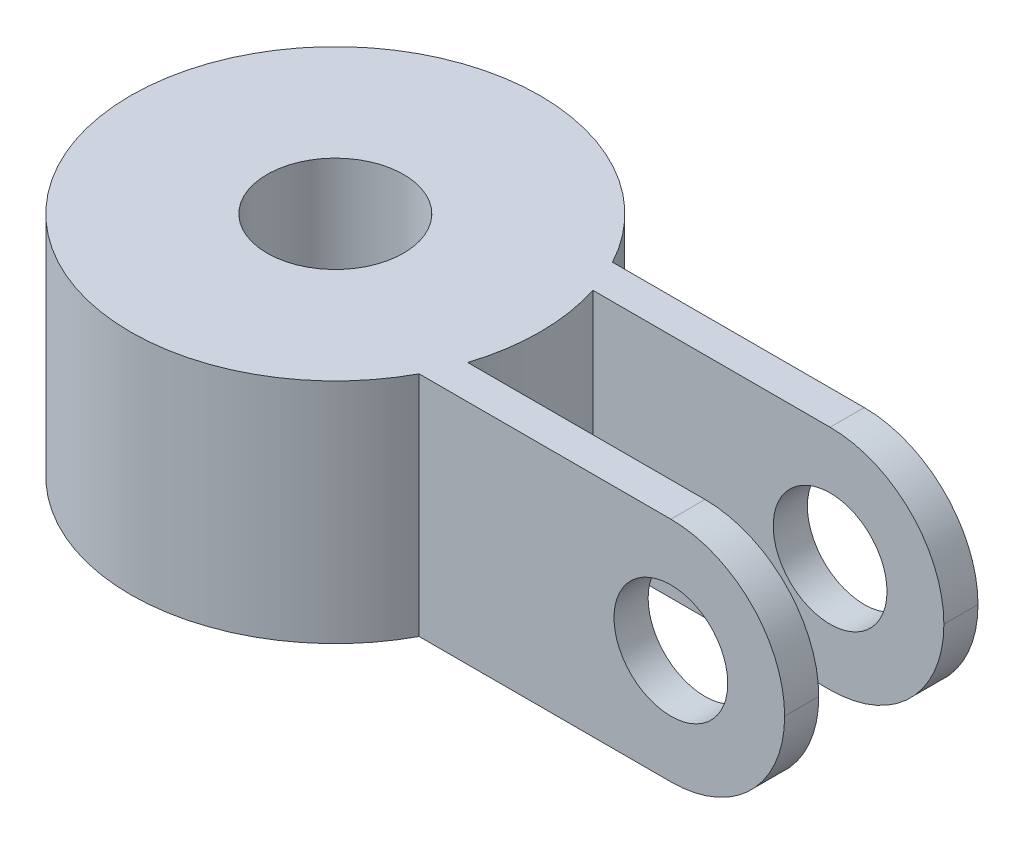
ISO-10303-21;
HEADER;
FILE_DESCRIPTION(('STEP AP214'),'2;1');
FILE_NAME('part.step','',(''),(''),'','','');
FILE_SCHEMA(('AUTOMOTIVE_DESIGN { 1 0 10303 214 1 1 1 1 }'));
ENDSEC;
DATA;
#1=APPLICATION_CONTEXT('core data for automotive mechanical design processes');
#2=APPLICATION_PROTOCOL_DEFINITION('international standard','automotive_design',2000,#1);
#3=PRODUCT_CONTEXT('',#1,'mechanical');
#4=PRODUCT('Part','Part','',(#3));
#5=PRODUCT_RELATED_PRODUCT_CATEGORY('part','',(#4));
#6=PRODUCT_DEFINITION_FORMATION('','',#4);
#7=PRODUCT_DEFINITION_CONTEXT('part definition',#1,'design');
#8=PRODUCT_DEFINITION('design','',#6,#7);
#9=PRODUCT_DEFINITION_SHAPE('','',#8);
#10=(LENGTH_UNIT() NAMED_UNIT(*) SI_UNIT(.MILLI.,.METRE.));
#11=(NAMED_UNIT(*) PLANE_ANGLE_UNIT() SI_UNIT($,.RADIAN.));
#12=(NAMED_UNIT(*) SI_UNIT($,.STERADIAN.) SOLID_ANGLE_UNIT());
#13=UNCERTAINTY_MEASURE_WITH_UNIT(LENGTH_MEASURE(1.E-05),#10,'distance_accuracy_value','');
#14=(GEOMETRIC_REPRESENTATION_CONTEXT(3) GLOBAL_UNCERTAINTY_ASSIGNED_CONTEXT((#13)) GLOBAL_UNIT_ASSIGNED_CONTEXT((#10,
#11,#12)) REPRESENTATION_CONTEXT('',''));
#15=CARTESIAN_POINT('',(0.,0.,0.));
#16=DIRECTION('',(0.,0.,1.));
#17=DIRECTION('',(1.,0.,0.));
#18=AXIS2_PLACEMENT_3D('',#15,#16,#17);
#19=CARTESIAN_POINT('',(0.,10.,0.));
#20=DIRECTION('',(0.,-1.,0.));
#21=DIRECTION('',(0.,0.,-1.));
#22=AXIS2_PLACEMENT_3D('',#19,#20,#21);
#23=CYLINDRICAL_SURFACE('',#22,9.);
#24=CARTESIAN_POINT('',(0.,10.,0.));
#25=DIRECTION('',(0.,1.,0.));
#26=DIRECTION('',(0.,0.,1.));
#27=AXIS2_PLACEMENT_3D('',#24,#25,#26);
#28=CIRCLE('',#27,9.);
#29=CARTESIAN_POINT('',(7.93331582631122,10.,-4.25));
#30=VERTEX_POINT('',#29);
#31=CARTESIAN_POINT('',(7.93331582631122,10.,4.25));
#32=VERTEX_POINT('',#31);
#33=EDGE_CURVE('E117',#30,#32,#28,.T.);
#34=ORIENTED_EDGE('',*,*,#33,.F.);
#35=DIRECTION('',(0.,-1.,0.));
#36=VECTOR('',#35,1.);
#37=CARTESIAN_POINT('',(7.93331582631122,26.9286114453922,-4.25));
#38=LINE('',#37,#36);
#39=CARTESIAN_POINT('',(7.93331582631122,0.,-4.25));
#40=VERTEX_POINT('',#39);
#41=EDGE_CURVE('E124',#30,#40,#38,.T.);
#42=ORIENTED_EDGE('',*,*,#41,.T.);
#43=CARTESIAN_POINT('',(0.,0.,0.));
#44=DIRECTION('',(0.,1.,0.));
#45=DIRECTION('',(0.,0.,1.));
#46=AXIS2_PLACEMENT_3D('',#43,#44,#45);
#47=CIRCLE('',#46,9.);
#48=CARTESIAN_POINT('',(7.93331582631122,0.,4.25));
#49=VERTEX_POINT('',#48);
#50=EDGE_CURVE('E142',#40,#49,#47,.T.);
#51=ORIENTED_EDGE('',*,*,#50,.T.);
#52=DIRECTION('',(0.,-1.,0.));
#53=VECTOR('',#52,1.);
#54=CARTESIAN_POINT('',(7.93331582631122,26.9286114453922,4.25));
#55=LINE('',#54,#53);
#56=EDGE_CURVE('E135',#32,#49,#55,.T.);
#57=ORIENTED_EDGE('',*,*,#56,.F.);
#58=EDGE_LOOP('',(#34,#42,#51,#57));
#59=FACE_BOUND('',#58,.T.);
#60=ADVANCED_FACE('F32',(#59),#23,.T.);
#61=CARTESIAN_POINT('',(0.,10.,0.));
#62=DIRECTION('',(0.,1.,0.));
#63=DIRECTION('',(0.,0.,1.));
#64=AXIS2_PLACEMENT_3D('',#61,#62,#63);
#65=PLANE('',#64);
#66=DIRECTION('',(-1.,0.,0.));
#67=VECTOR('',#66,1.);
#68=CARTESIAN_POINT('',(24.,10.,-2.75));
#69=LINE('',#68,#67);
#70=CARTESIAN_POINT('',(19.,10.,-2.75));
#71=VERTEX_POINT('',#70);
#72=CARTESIAN_POINT('',(8.56956825050131,10.,-2.75));
#73=VERTEX_POINT('',#72);
#74=EDGE_CURVE('E123',#71,#73,#69,.T.);
#75=ORIENTED_EDGE('',*,*,#74,.F.);
#76=DIRECTION('',(0.,0.,1.));
#77=VECTOR('',#76,1.);
#78=CARTESIAN_POINT('',(19.,10.,0.));
#79=LINE('',#78,#77);
#80=CARTESIAN_POINT('',(19.,10.,-4.25));
#81=VERTEX_POINT('',#80);
#82=EDGE_CURVE('E120',#71,#81,#79,.F.);
#83=ORIENTED_EDGE('',*,*,#82,.T.);
#84=DIRECTION('',(1.,0.,0.));
#85=VECTOR('',#84,1.);
#86=CARTESIAN_POINT('',(7.93331582631122,10.,-4.25));
#87=LINE('',#86,#85);
#88=EDGE_CURVE('E110',#30,#81,#87,.T.);
#89=ORIENTED_EDGE('',*,*,#88,.F.);
#90=ORIENTED_EDGE('',*,*,#33,.T.);
#91=DIRECTION('',(-1.,0.,0.));
#92=VECTOR('',#91,1.);
#93=CARTESIAN_POINT('',(7.93331582631122,10.,4.25));
#94=LINE('',#93,#92);
#95=CARTESIAN_POINT('',(19.,10.,4.25));
#96=VERTEX_POINT('',#95);
#97=EDGE_CURVE('E201',#96,#32,#94,.T.);
#98=ORIENTED_EDGE('',*,*,#97,.F.);
#99=DIRECTION('',(0.,0.,1.));
#100=VECTOR('',#99,1.);
#101=CARTESIAN_POINT('',(19.,10.,0.));
#102=LINE('',#101,#100);
#103=CARTESIAN_POINT('',(19.,10.,2.75));
#104=VERTEX_POINT('',#103);
#105=EDGE_CURVE('E166',#96,#104,#102,.F.);
#106=ORIENTED_EDGE('',*,*,#105,.T.);
#107=DIRECTION('',(1.,0.,0.));
#108=VECTOR('',#107,1.);
#109=CARTESIAN_POINT('',(24.,10.,2.75));
#110=LINE('',#109,#108);
#111=CARTESIAN_POINT('',(8.56956825050131,10.,2.75));
#112=VERTEX_POINT('',#111);
#113=EDGE_CURVE('E197',#112,#104,#110,.T.);
#114=ORIENTED_EDGE('',*,*,#113,.F.);
#115=EDGE_CURVE('E136',#112,#73,#28,.T.);
#116=ORIENTED_EDGE('',*,*,#115,.T.);
#117=EDGE_LOOP('',(#75,#83,#89,#90,#98,#106,#114,#116));
#118=FACE_BOUND('',#117,.T.);
#119=CARTESIAN_POINT('',(0.,10.,0.));
#120=DIRECTION('',(0.,1.,0.));
#121=DIRECTION('',(0.,0.,1.));
#122=AXIS2_PLACEMENT_3D('',#119,#120,#121);
#123=CIRCLE('',#122,3.);
#124=CARTESIAN_POINT('',(0.,10.,3.));
#125=VERTEX_POINT('',#124);
#126=EDGE_CURVE('E203',#125,#125,#123,.T.);
#127=ORIENTED_EDGE('',*,*,#126,.F.);
#128=EDGE_LOOP('',(#127));
#129=FACE_BOUND('',#128,.T.);
#130=ADVANCED_FACE('F113',(#118,#129),#65,.T.);
#131=CARTESIAN_POINT('',(0.,0.,0.));
#132=DIRECTION('',(0.,1.,0.));
#133=DIRECTION('',(0.,0.,1.));
#134=AXIS2_PLACEMENT_3D('',#131,#132,#133);
#135=PLANE('',#134);
#136=DIRECTION('',(1.,0.,0.));
#137=VECTOR('',#136,1.);
#138=CARTESIAN_POINT('',(7.93331582631122,0.,-4.25));
#139=LINE('',#138,#137);
#140=CARTESIAN_POINT('',(19.,0.,-4.25));
#141=VERTEX_POINT('',#140);
#142=EDGE_CURVE('E129',#40,#141,#139,.T.);
#143=ORIENTED_EDGE('',*,*,#142,.T.);
#144=DIRECTION('',(0.,0.,1.));
#145=VECTOR('',#144,1.);
#146=CARTESIAN_POINT('',(19.,0.,-2.75));
#147=LINE('',#146,#145);
#148=CARTESIAN_POINT('',(19.,0.,-2.75));
#149=VERTEX_POINT('',#148);
#150=EDGE_CURVE('E155',#141,#149,#147,.T.);
#151=ORIENTED_EDGE('',*,*,#150,.T.);
#152=DIRECTION('',(-1.,0.,0.));
#153=VECTOR('',#152,1.);
#154=CARTESIAN_POINT('',(24.,0.,-2.75));
#155=LINE('',#154,#153);
#156=CARTESIAN_POINT('',(8.56956825050131,0.,-2.75));
#157=VERTEX_POINT('',#156);
#158=EDGE_CURVE('E176',#149,#157,#155,.T.);
#159=ORIENTED_EDGE('',*,*,#158,.T.);
#160=CARTESIAN_POINT('',(8.56956825050131,0.,2.75));
#161=VERTEX_POINT('',#160);
#162=EDGE_CURVE('E137',#161,#157,#47,.T.);
#163=ORIENTED_EDGE('',*,*,#162,.F.);
#164=DIRECTION('',(1.,0.,0.));
#165=VECTOR('',#164,1.);
#166=CARTESIAN_POINT('',(24.,0.,2.75));
#167=LINE('',#166,#165);
#168=CARTESIAN_POINT('',(19.,0.,2.75));
#169=VERTEX_POINT('',#168);
#170=EDGE_CURVE('E193',#161,#169,#167,.T.);
#171=ORIENTED_EDGE('',*,*,#170,.T.);
#172=DIRECTION('',(0.,0.,1.));
#173=VECTOR('',#172,1.);
#174=CARTESIAN_POINT('',(19.,0.,4.25));
#175=LINE('',#174,#173);
#176=CARTESIAN_POINT('',(19.,0.,4.25));
#177=VERTEX_POINT('',#176);
#178=EDGE_CURVE('E153',#169,#177,#175,.T.);
#179=ORIENTED_EDGE('',*,*,#178,.T.);
#180=DIRECTION('',(-1.,0.,0.));
#181=VECTOR('',#180,1.);
#182=CARTESIAN_POINT('',(7.93331582631122,0.,4.25));
#183=LINE('',#182,#181);
#184=EDGE_CURVE('E195',#177,#49,#183,.T.);
#185=ORIENTED_EDGE('',*,*,#184,.T.);
#186=ORIENTED_EDGE('',*,*,#50,.F.);
#187=EDGE_LOOP('',(#143,#151,#159,#163,#171,#179,#185,#186));
#188=FACE_BOUND('',#187,.T.);
#189=CARTESIAN_POINT('',(0.,0.,0.));
#190=DIRECTION('',(0.,1.,0.));
#191=DIRECTION('',(0.,0.,1.));
#192=AXIS2_PLACEMENT_3D('',#189,#190,#191);
#193=CIRCLE('',#192,3.);
#194=CARTESIAN_POINT('',(0.,0.,3.));
#195=VERTEX_POINT('',#194);
#196=EDGE_CURVE('E145',#195,#195,#193,.T.);
#197=ORIENTED_EDGE('',*,*,#196,.T.);
#198=EDGE_LOOP('',(#197));
#199=FACE_BOUND('',#198,.T.);
#200=ADVANCED_FACE('F210',(#188,#199),#135,.F.);
#201=ORIENTED_EDGE('',*,*,#162,.T.);
#202=DIRECTION('',(0.,-1.,0.));
#203=VECTOR('',#202,1.);
#204=CARTESIAN_POINT('',(8.56956825050131,10.,-2.75));
#205=LINE('',#204,#203);
#206=EDGE_CURVE('E150',#157,#73,#205,.F.);
#207=ORIENTED_EDGE('',*,*,#206,.T.);
#208=ORIENTED_EDGE('',*,*,#115,.F.);
#209=DIRECTION('',(0.,-1.,0.));
#210=VECTOR('',#209,1.);
#211=CARTESIAN_POINT('',(8.56956825050131,10.,2.75));
#212=LINE('',#211,#210);
#213=EDGE_CURVE('E140',#112,#161,#212,.T.);
#214=ORIENTED_EDGE('',*,*,#213,.T.);
#215=EDGE_LOOP('',(#201,#207,#208,#214));
#216=FACE_BOUND('',#215,.T.);
#217=ADVANCED_FACE('F215',(#216),#23,.T.);
#218=CARTESIAN_POINT('',(0.,10.,0.));
#219=DIRECTION('',(0.,-1.,0.));
#220=DIRECTION('',(0.,0.,-1.));
#221=AXIS2_PLACEMENT_3D('',#218,#219,#220);
#222=CYLINDRICAL_SURFACE('',#221,3.);
#223=ORIENTED_EDGE('',*,*,#126,.T.);
#224=EDGE_LOOP('',(#223));
#225=FACE_BOUND('',#224,.T.);
#226=ORIENTED_EDGE('',*,*,#196,.F.);
#227=EDGE_LOOP('',(#226));
#228=FACE_BOUND('',#227,.T.);
#229=ADVANCED_FACE('F212',(#225,#228),#222,.F.);
#230=CARTESIAN_POINT('',(24.,26.9286114453922,2.75));
#231=DIRECTION('',(0.,0.,-1.));
#232=DIRECTION('',(-1.,0.,0.));
#233=AXIS2_PLACEMENT_3D('',#230,#231,#232);
#234=PLANE('',#233);
#235=CARTESIAN_POINT('',(19.,5.,2.75));
#236=DIRECTION('',(0.,0.,-1.));
#237=DIRECTION('',(-1.,0.,0.));
#238=AXIS2_PLACEMENT_3D('',#235,#236,#237);
#239=CIRCLE('',#238,2.5);
#240=CARTESIAN_POINT('',(16.5,5.,2.75));
#241=VERTEX_POINT('',#240);
#242=EDGE_CURVE('E179',#241,#241,#239,.T.);
#243=ORIENTED_EDGE('',*,*,#242,.F.);
#244=EDGE_LOOP('',(#243));
#245=FACE_BOUND('',#244,.T.);
#246=ORIENTED_EDGE('',*,*,#113,.T.);
#247=CARTESIAN_POINT('',(19.,5.,2.75));
#248=DIRECTION('',(0.,0.,-1.));
#249=DIRECTION('',(-1.,0.,0.));
#250=AXIS2_PLACEMENT_3D('',#247,#248,#249);
#251=CIRCLE('',#250,5.);
#252=CARTESIAN_POINT('',(24.,5.,2.75));
#253=VERTEX_POINT('',#252);
#254=EDGE_CURVE('E11',#104,#253,#251,.T.);
#255=ORIENTED_EDGE('',*,*,#254,.T.);
#256=CARTESIAN_POINT('',(19.,5.,2.75));
#257=DIRECTION('',(0.,0.,-1.));
#258=DIRECTION('',(-1.,0.,0.));
#259=AXIS2_PLACEMENT_3D('',#256,#257,#258);
#260=CIRCLE('',#259,5.);
#261=EDGE_CURVE('E41',#253,#169,#260,.T.);
#262=ORIENTED_EDGE('',*,*,#261,.T.);
#263=ORIENTED_EDGE('',*,*,#170,.F.);
#264=ORIENTED_EDGE('',*,*,#213,.F.);
#265=EDGE_LOOP('',(#246,#255,#262,#263,#264));
#266=FACE_BOUND('',#265,.T.);
#267=ADVANCED_FACE('F214',(#245,#266),#234,.T.);
#268=CARTESIAN_POINT('',(7.93331582631122,26.9286114453922,4.25));
#269=DIRECTION('',(0.,0.,1.));
#270=DIRECTION('',(1.,0.,0.));
#271=AXIS2_PLACEMENT_3D('',#268,#269,#270);
#272=PLANE('',#271);
#273=CARTESIAN_POINT('',(19.,5.,4.25));
#274=DIRECTION('',(0.,0.,1.));
#275=DIRECTION('',(1.,0.,0.));
#276=AXIS2_PLACEMENT_3D('',#273,#274,#275);
#277=CIRCLE('',#276,2.5);
#278=CARTESIAN_POINT('',(21.5,5.,4.25));
#279=VERTEX_POINT('',#278);
#280=EDGE_CURVE('E282',#279,#279,#277,.T.);
#281=ORIENTED_EDGE('',*,*,#280,.F.);
#282=EDGE_LOOP('',(#281));
#283=FACE_BOUND('',#282,.T.);
#284=CARTESIAN_POINT('',(19.,5.,4.25));
#285=DIRECTION('',(0.,0.,1.));
#286=DIRECTION('',(1.,0.,0.));
#287=AXIS2_PLACEMENT_3D('',#284,#285,#286);
#288=CIRCLE('',#287,5.);
#289=CARTESIAN_POINT('',(24.,5.,4.25));
#290=VERTEX_POINT('',#289);
#291=EDGE_CURVE('E55',#177,#290,#288,.T.);
#292=ORIENTED_EDGE('',*,*,#291,.T.);
#293=CARTESIAN_POINT('',(19.,5.,4.25));
#294=DIRECTION('',(0.,0.,1.));
#295=DIRECTION('',(1.,0.,0.));
#296=AXIS2_PLACEMENT_3D('',#293,#294,#295);
#297=CIRCLE('',#296,5.);
#298=EDGE_CURVE('E171',#290,#96,#297,.T.);
#299=ORIENTED_EDGE('',*,*,#298,.T.);
#300=ORIENTED_EDGE('',*,*,#97,.T.);
#301=ORIENTED_EDGE('',*,*,#56,.T.);
#302=ORIENTED_EDGE('',*,*,#184,.F.);
#303=EDGE_LOOP('',(#292,#299,#300,#301,#302));
#304=FACE_BOUND('',#303,.T.);
#305=ADVANCED_FACE('F221',(#283,#304),#272,.T.);
#306=CARTESIAN_POINT('',(24.,26.9286114453922,-2.75));
#307=DIRECTION('',(0.,0.,1.));
#308=DIRECTION('',(1.,0.,0.));
#309=AXIS2_PLACEMENT_3D('',#306,#307,#308);
#310=PLANE('',#309);
#311=CARTESIAN_POINT('',(19.,5.,-2.75));
#312=DIRECTION('',(0.,0.,1.));
#313=DIRECTION('',(1.,0.,0.));
#314=AXIS2_PLACEMENT_3D('',#311,#312,#313);
#315=CIRCLE('',#314,2.5);
#316=CARTESIAN_POINT('',(21.5,5.,-2.75));
#317=VERTEX_POINT('',#316);
#318=EDGE_CURVE('E183',#317,#317,#315,.T.);
#319=ORIENTED_EDGE('',*,*,#318,.F.);
#320=EDGE_LOOP('',(#319));
#321=FACE_BOUND('',#320,.T.);
#322=ORIENTED_EDGE('',*,*,#158,.F.);
#323=CARTESIAN_POINT('',(19.,5.,-2.75));
#324=DIRECTION('',(0.,0.,1.));
#325=DIRECTION('',(1.,0.,0.));
#326=AXIS2_PLACEMENT_3D('',#323,#324,#325);
#327=CIRCLE('',#326,5.);
#328=CARTESIAN_POINT('',(24.,5.,-2.75));
#329=VERTEX_POINT('',#328);
#330=EDGE_CURVE('E160',#149,#329,#327,.T.);
#331=ORIENTED_EDGE('',*,*,#330,.T.);
#332=CARTESIAN_POINT('',(19.,5.,-2.75));
#333=DIRECTION('',(0.,0.,1.));
#334=DIRECTION('',(1.,0.,0.));
#335=AXIS2_PLACEMENT_3D('',#332,#333,#334);
#336=CIRCLE('',#335,5.);
#337=EDGE_CURVE('E158',#329,#71,#336,.T.);
#338=ORIENTED_EDGE('',*,*,#337,.T.);
#339=ORIENTED_EDGE('',*,*,#74,.T.);
#340=ORIENTED_EDGE('',*,*,#206,.F.);
#341=EDGE_LOOP('',(#322,#331,#338,#339,#340));
#342=FACE_BOUND('',#341,.T.);
#343=ADVANCED_FACE('F261',(#321,#342),#310,.T.);
#344=CARTESIAN_POINT('',(7.93331582631122,26.9286114453922,-4.25));
#345=DIRECTION('',(0.,0.,-1.));
#346=DIRECTION('',(-1.,0.,0.));
#347=AXIS2_PLACEMENT_3D('',#344,#345,#346);
#348=PLANE('',#347);
#349=CARTESIAN_POINT('',(19.,5.,-4.25));
#350=DIRECTION('',(0.,0.,-1.));
#351=DIRECTION('',(-1.,0.,0.));
#352=AXIS2_PLACEMENT_3D('',#349,#350,#351);
#353=CIRCLE('',#352,2.5);
#354=CARTESIAN_POINT('',(16.5,5.,-4.25));
#355=VERTEX_POINT('',#354);
#356=EDGE_CURVE('E36',#355,#355,#353,.T.);
#357=ORIENTED_EDGE('',*,*,#356,.F.);
#358=EDGE_LOOP('',(#357));
#359=FACE_BOUND('',#358,.T.);
#360=CARTESIAN_POINT('',(19.,5.,-4.25));
#361=DIRECTION('',(0.,0.,-1.));
#362=DIRECTION('',(-1.,0.,0.));
#363=AXIS2_PLACEMENT_3D('',#360,#361,#362);
#364=CIRCLE('',#363,5.);
#365=CARTESIAN_POINT('',(24.,5.,-4.25));
#366=VERTEX_POINT('',#365);
#367=EDGE_CURVE('E162',#81,#366,#364,.T.);
#368=ORIENTED_EDGE('',*,*,#367,.T.);
#369=CARTESIAN_POINT('',(19.,5.,-4.25));
#370=DIRECTION('',(0.,0.,-1.));
#371=DIRECTION('',(-1.,0.,0.));
#372=AXIS2_PLACEMENT_3D('',#369,#370,#371);
#373=CIRCLE('',#372,5.);
#374=EDGE_CURVE('E164',#366,#141,#373,.T.);
#375=ORIENTED_EDGE('',*,*,#374,.T.);
#376=ORIENTED_EDGE('',*,*,#142,.F.);
#377=ORIENTED_EDGE('',*,*,#41,.F.);
#378=ORIENTED_EDGE('',*,*,#88,.T.);
#379=EDGE_LOOP('',(#368,#375,#376,#377,#378));
#380=FACE_BOUND('',#379,.T.);
#381=ADVANCED_FACE('F127',(#359,#380),#348,.T.);
#382=CARTESIAN_POINT('',(19.,5.,-4.25));
#383=DIRECTION('',(0.,0.,1.));
#384=DIRECTION('',(1.,0.,0.));
#385=AXIS2_PLACEMENT_3D('',#382,#383,#384);
#386=CYLINDRICAL_SURFACE('',#385,5.);
#387=DIRECTION('',(0.,0.,1.));
#388=VECTOR('',#387,1.);
#389=CARTESIAN_POINT('',(24.,5.,-4.25));
#390=LINE('',#389,#388);
#391=EDGE_CURVE('E174',#366,#329,#390,.T.);
#392=ORIENTED_EDGE('',*,*,#391,.F.);
#393=ORIENTED_EDGE('',*,*,#367,.F.);
#394=ORIENTED_EDGE('',*,*,#82,.F.);
#395=ORIENTED_EDGE('',*,*,#337,.F.);
#396=EDGE_LOOP('',(#392,#393,#394,#395));
#397=FACE_BOUND('',#396,.T.);
#398=ADVANCED_FACE('F236',(#397),#386,.T.);
#399=CARTESIAN_POINT('',(19.,5.,0.));
#400=DIRECTION('',(0.,0.,-1.));
#401=DIRECTION('',(-1.,0.,0.));
#402=AXIS2_PLACEMENT_3D('',#399,#400,#401);
#403=CYLINDRICAL_SURFACE('',#402,5.);
#404=ORIENTED_EDGE('',*,*,#374,.F.);
#405=ORIENTED_EDGE('',*,*,#391,.T.);
#406=ORIENTED_EDGE('',*,*,#330,.F.);
#407=ORIENTED_EDGE('',*,*,#150,.F.);
#408=EDGE_LOOP('',(#404,#405,#406,#407));
#409=FACE_BOUND('',#408,.T.);
#410=ADVANCED_FACE('F233',(#409),#403,.T.);
#411=CARTESIAN_POINT('',(19.,5.,0.));
#412=DIRECTION('',(0.,0.,-1.));
#413=DIRECTION('',(-1.,0.,0.));
#414=AXIS2_PLACEMENT_3D('',#411,#412,#413);
#415=CYLINDRICAL_SURFACE('',#414,5.);
#416=ORIENTED_EDGE('',*,*,#178,.F.);
#417=ORIENTED_EDGE('',*,*,#261,.F.);
#418=DIRECTION('',(0.,0.,1.));
#419=VECTOR('',#418,1.);
#420=CARTESIAN_POINT('',(24.,5.,2.75));
#421=LINE('',#420,#419);
#422=EDGE_CURVE('E177',#290,#253,#421,.F.);
#423=ORIENTED_EDGE('',*,*,#422,.F.);
#424=ORIENTED_EDGE('',*,*,#291,.F.);
#425=EDGE_LOOP('',(#416,#417,#423,#424));
#426=FACE_BOUND('',#425,.T.);
#427=ADVANCED_FACE('F34',(#426),#415,.T.);
#428=CARTESIAN_POINT('',(19.,5.,4.25));
#429=DIRECTION('',(0.,0.,1.));
#430=DIRECTION('',(1.,0.,0.));
#431=AXIS2_PLACEMENT_3D('',#428,#429,#430);
#432=CYLINDRICAL_SURFACE('',#431,5.);
#433=ORIENTED_EDGE('',*,*,#254,.F.);
#434=ORIENTED_EDGE('',*,*,#105,.F.);
#435=ORIENTED_EDGE('',*,*,#298,.F.);
#436=ORIENTED_EDGE('',*,*,#422,.T.);
#437=EDGE_LOOP('',(#433,#434,#435,#436));
#438=FACE_BOUND('',#437,.T.);
#439=ADVANCED_FACE('F240',(#438),#432,.T.);
#440=CARTESIAN_POINT('',(19.,5.,-20.75));
#441=DIRECTION('',(0.,0.,1.));
#442=DIRECTION('',(1.,0.,0.));
#443=AXIS2_PLACEMENT_3D('',#440,#441,#442);
#444=CYLINDRICAL_SURFACE('',#443,2.5);
#445=ORIENTED_EDGE('',*,*,#318,.T.);
#446=EDGE_LOOP('',(#445));
#447=FACE_BOUND('',#446,.T.);
#448=ORIENTED_EDGE('',*,*,#356,.T.);
#449=EDGE_LOOP('',(#448));
#450=FACE_BOUND('',#449,.T.);
#451=ADVANCED_FACE('F242',(#447,#450),#444,.F.);
#452=ORIENTED_EDGE('',*,*,#242,.T.);
#453=EDGE_LOOP('',(#452));
#454=FACE_BOUND('',#453,.T.);
#455=ORIENTED_EDGE('',*,*,#280,.T.);
#456=EDGE_LOOP('',(#455));
#457=FACE_BOUND('',#456,.T.);
#458=ADVANCED_FACE('F247',(#454,#457),#444,.F.);
#459=CLOSED_SHELL('',(#60,#130,#200,#217,#229,#267,#305,#343,#381,#398,#410,#427,#439,#451,#458));
#460=MANIFOLD_SOLID_BREP('B2',#459);
#461=ADVANCED_BREP_SHAPE_REPRESENTATION('',(#18,#460),#14);
#462=SHAPE_DEFINITION_REPRESENTATION(#9,#461);
ENDSEC;
END-ISO-10303-21;
